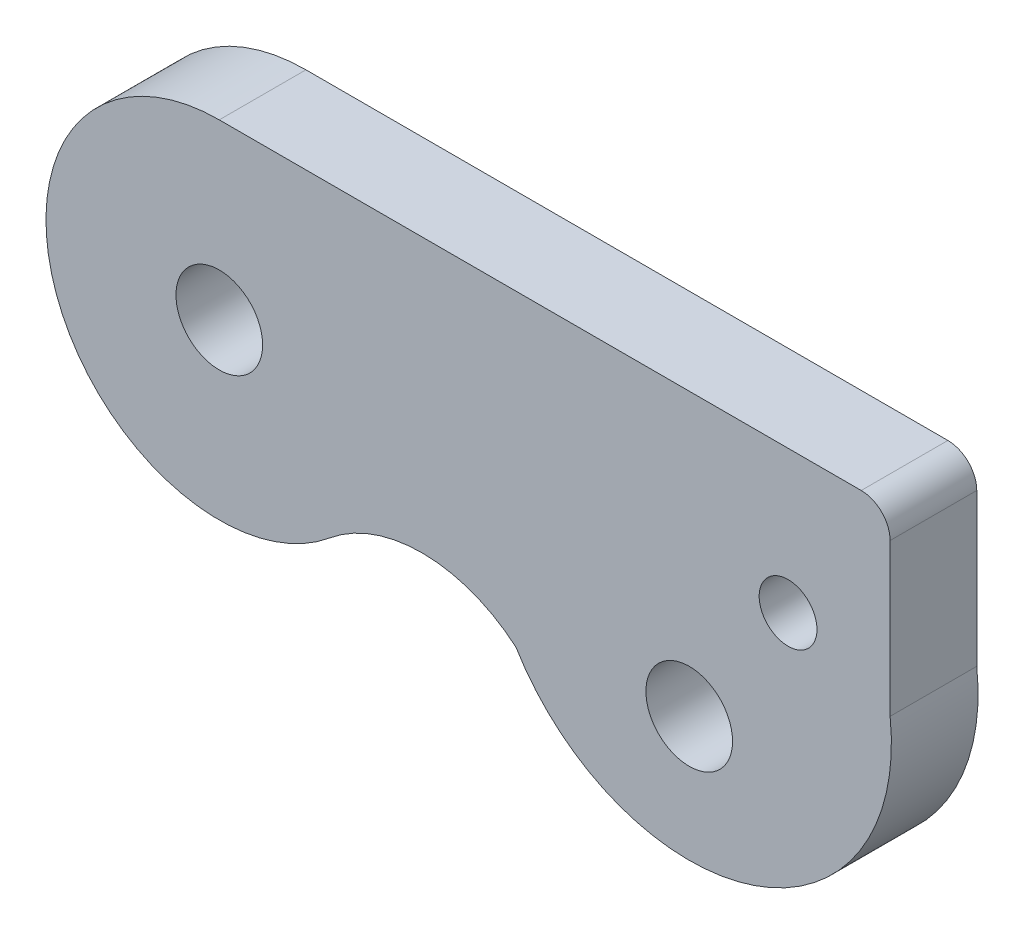
ISO-10303-21;
HEADER;
FILE_DESCRIPTION(('STEP AP214'),'2;1');
FILE_NAME('part.step','',(''),(''),'','','');
FILE_SCHEMA(('AUTOMOTIVE_DESIGN { 1 0 10303 214 1 1 1 1 }'));
ENDSEC;
DATA;
#1=APPLICATION_CONTEXT('core data for automotive mechanical design processes');
#2=APPLICATION_PROTOCOL_DEFINITION('international standard','automotive_design',2000,#1);
#3=PRODUCT_CONTEXT('',#1,'mechanical');
#4=PRODUCT('Part','Part','',(#3));
#5=PRODUCT_RELATED_PRODUCT_CATEGORY('part','',(#4));
#6=PRODUCT_DEFINITION_FORMATION('','',#4);
#7=PRODUCT_DEFINITION_CONTEXT('part definition',#1,'design');
#8=PRODUCT_DEFINITION('design','',#6,#7);
#9=PRODUCT_DEFINITION_SHAPE('','',#8);
#10=(LENGTH_UNIT() NAMED_UNIT(*) SI_UNIT(.MILLI.,.METRE.));
#11=(NAMED_UNIT(*) PLANE_ANGLE_UNIT() SI_UNIT($,.RADIAN.));
#12=(NAMED_UNIT(*) SI_UNIT($,.STERADIAN.) SOLID_ANGLE_UNIT());
#13=UNCERTAINTY_MEASURE_WITH_UNIT(LENGTH_MEASURE(1.E-05),#10,'distance_accuracy_value','');
#14=(GEOMETRIC_REPRESENTATION_CONTEXT(3) GLOBAL_UNCERTAINTY_ASSIGNED_CONTEXT((#13)) GLOBAL_UNIT_ASSIGNED_CONTEXT((#10,
#11,#12)) REPRESENTATION_CONTEXT('',''));
#15=CARTESIAN_POINT('',(0.,0.,0.));
#16=DIRECTION('',(0.,0.,1.));
#17=DIRECTION('',(1.,0.,0.));
#18=AXIS2_PLACEMENT_3D('',#15,#16,#17);
#19=CARTESIAN_POINT('',(0.,-6.,3.));
#20=DIRECTION('',(0.,0.,1.));
#21=DIRECTION('',(1.,0.,0.));
#22=AXIS2_PLACEMENT_3D('',#19,#20,#21);
#23=PLANE('',#22);
#24=CARTESIAN_POINT('',(19.6906458159987,-4.93616233806258,3.));
#25=DIRECTION('',(0.,0.,1.));
#26=DIRECTION('',(1.,0.,0.));
#27=AXIS2_PLACEMENT_3D('',#24,#25,#26);
#28=CIRCLE('',#27,0.999999999999994);
#29=CARTESIAN_POINT('',(20.6906458159987,-4.93616233806258,3.));
#30=VERTEX_POINT('',#29);
#31=EDGE_CURVE('E153',#30,#30,#28,.T.);
#32=ORIENTED_EDGE('',*,*,#31,.F.);
#33=EDGE_LOOP('',(#32));
#34=FACE_BOUND('',#33,.T.);
#35=CARTESIAN_POINT('',(0.,-6.,3.));
#36=DIRECTION('',(0.,0.,1.));
#37=DIRECTION('',(1.,0.,0.));
#38=AXIS2_PLACEMENT_3D('',#35,#36,#37);
#39=CIRCLE('',#38,6.);
#40=CARTESIAN_POINT('',(0.,0.,3.));
#41=VERTEX_POINT('',#40);
#42=CARTESIAN_POINT('',(3.82727225710111,-10.6208210385195,3.));
#43=VERTEX_POINT('',#42);
#44=EDGE_CURVE('E134',#41,#43,#39,.T.);
#45=ORIENTED_EDGE('',*,*,#44,.T.);
#46=CARTESIAN_POINT('',(7.01666580468537,-14.4715052372857,3.));
#47=DIRECTION('',(0.,0.,-1.));
#48=DIRECTION('',(-1.,0.,0.));
#49=AXIS2_PLACEMENT_3D('',#46,#47,#48);
#50=CIRCLE('',#49,5.);
#51=CARTESIAN_POINT('',(10.269229399763,-10.6740284355164,3.));
#52=VERTEX_POINT('',#51);
#53=EDGE_CURVE('E88',#43,#52,#50,.T.);
#54=ORIENTED_EDGE('',*,*,#53,.T.);
#55=CARTESIAN_POINT('',(16.2687627712159,-7.06770075700153,3.));
#56=DIRECTION('',(0.,0.,1.));
#57=DIRECTION('',(1.,0.,0.));
#58=AXIS2_PLACEMENT_3D('',#55,#56,#57);
#59=CIRCLE('',#58,7.);
#60=CARTESIAN_POINT('',(23.2233881055421,-6.2719706148369,3.));
#61=VERTEX_POINT('',#60);
#62=EDGE_CURVE('E102',#52,#61,#59,.T.);
#63=ORIENTED_EDGE('',*,*,#62,.T.);
#64=DIRECTION('',(0.,1.,0.));
#65=VECTOR('',#64,1.);
#66=CARTESIAN_POINT('',(23.2233881055421,-6.2719706148369,3.));
#67=LINE('',#66,#65);
#68=CARTESIAN_POINT('',(23.2233881055421,-1.,3.));
#69=VERTEX_POINT('',#68);
#70=EDGE_CURVE('E95',#61,#69,#67,.T.);
#71=ORIENTED_EDGE('',*,*,#70,.T.);
#72=CARTESIAN_POINT('',(22.2233881055421,-1.,3.));
#73=DIRECTION('',(0.,0.,1.));
#74=DIRECTION('',(1.,0.,0.));
#75=AXIS2_PLACEMENT_3D('',#72,#73,#74);
#76=CIRCLE('',#75,1.);
#77=CARTESIAN_POINT('',(22.2233881055421,0.,3.));
#78=VERTEX_POINT('',#77);
#79=EDGE_CURVE('E99',#69,#78,#76,.T.);
#80=ORIENTED_EDGE('',*,*,#79,.T.);
#81=DIRECTION('',(-1.,0.,0.));
#82=VECTOR('',#81,1.);
#83=CARTESIAN_POINT('',(22.,0.,3.));
#84=LINE('',#83,#82);
#85=EDGE_CURVE('E53',#78,#41,#84,.T.);
#86=ORIENTED_EDGE('',*,*,#85,.T.);
#87=EDGE_LOOP('',(#45,#54,#63,#71,#80,#86));
#88=FACE_BOUND('',#87,.T.);
#89=CARTESIAN_POINT('',(0.,-6.,3.));
#90=DIRECTION('',(0.,0.,1.));
#91=DIRECTION('',(1.,0.,0.));
#92=AXIS2_PLACEMENT_3D('',#89,#90,#91);
#93=CIRCLE('',#92,1.5);
#94=CARTESIAN_POINT('',(1.5,-6.,3.));
#95=VERTEX_POINT('',#94);
#96=EDGE_CURVE('E126',#95,#95,#93,.T.);
#97=ORIENTED_EDGE('',*,*,#96,.F.);
#98=EDGE_LOOP('',(#97));
#99=FACE_BOUND('',#98,.T.);
#100=CARTESIAN_POINT('',(16.2687627712159,-9.74796623904576,3.));
#101=DIRECTION('',(0.,0.,1.));
#102=DIRECTION('',(1.,0.,0.));
#103=AXIS2_PLACEMENT_3D('',#100,#101,#102);
#104=CIRCLE('',#103,1.5);
#105=CARTESIAN_POINT('',(17.7687627712159,-9.74796623904576,3.));
#106=VERTEX_POINT('',#105);
#107=EDGE_CURVE('E159',#106,#106,#104,.T.);
#108=ORIENTED_EDGE('',*,*,#107,.F.);
#109=EDGE_LOOP('',(#108));
#110=FACE_BOUND('',#109,.T.);
#111=ADVANCED_FACE('F36',(#34,#88,#99,#110),#23,.T.);
#112=CARTESIAN_POINT('',(0.,-6.,0.));
#113=DIRECTION('',(0.,0.,1.));
#114=DIRECTION('',(1.,0.,0.));
#115=AXIS2_PLACEMENT_3D('',#112,#113,#114);
#116=PLANE('',#115);
#117=CARTESIAN_POINT('',(0.,-6.,0.));
#118=DIRECTION('',(0.,0.,1.));
#119=DIRECTION('',(1.,0.,0.));
#120=AXIS2_PLACEMENT_3D('',#117,#118,#119);
#121=CIRCLE('',#120,6.);
#122=CARTESIAN_POINT('',(0.,0.,0.));
#123=VERTEX_POINT('',#122);
#124=CARTESIAN_POINT('',(3.82727225710111,-10.6208210385195,0.));
#125=VERTEX_POINT('',#124);
#126=EDGE_CURVE('E122',#123,#125,#121,.T.);
#127=ORIENTED_EDGE('',*,*,#126,.F.);
#128=DIRECTION('',(-1.,0.,0.));
#129=VECTOR('',#128,1.);
#130=CARTESIAN_POINT('',(0.,0.,0.));
#131=LINE('',#130,#129);
#132=CARTESIAN_POINT('',(22.2233881055421,0.,0.));
#133=VERTEX_POINT('',#132);
#134=EDGE_CURVE('E76',#133,#123,#131,.T.);
#135=ORIENTED_EDGE('',*,*,#134,.F.);
#136=CARTESIAN_POINT('',(22.2233881055421,-1.,0.));
#137=DIRECTION('',(0.,0.,1.));
#138=DIRECTION('',(1.,0.,0.));
#139=AXIS2_PLACEMENT_3D('',#136,#137,#138);
#140=CIRCLE('',#139,1.);
#141=CARTESIAN_POINT('',(23.2233881055421,-1.,0.));
#142=VERTEX_POINT('',#141);
#143=EDGE_CURVE('E131',#142,#133,#140,.T.);
#144=ORIENTED_EDGE('',*,*,#143,.F.);
#145=DIRECTION('',(0.,1.,0.));
#146=VECTOR('',#145,1.);
#147=CARTESIAN_POINT('',(23.2233881055421,-6.2719706148369,0.));
#148=LINE('',#147,#146);
#149=CARTESIAN_POINT('',(23.2233881055421,-6.2719706148369,0.));
#150=VERTEX_POINT('',#149);
#151=EDGE_CURVE('E111',#150,#142,#148,.T.);
#152=ORIENTED_EDGE('',*,*,#151,.F.);
#153=CARTESIAN_POINT('',(16.2687627712159,-7.06770075700153,0.));
#154=DIRECTION('',(0.,0.,1.));
#155=DIRECTION('',(1.,0.,0.));
#156=AXIS2_PLACEMENT_3D('',#153,#154,#155);
#157=CIRCLE('',#156,7.);
#158=CARTESIAN_POINT('',(10.269229399763,-10.6740284355164,0.));
#159=VERTEX_POINT('',#158);
#160=EDGE_CURVE('E128',#159,#150,#157,.T.);
#161=ORIENTED_EDGE('',*,*,#160,.F.);
#162=CARTESIAN_POINT('',(7.01666580468537,-14.4715052372857,0.));
#163=DIRECTION('',(0.,0.,-1.));
#164=DIRECTION('',(-1.,0.,0.));
#165=AXIS2_PLACEMENT_3D('',#162,#163,#164);
#166=CIRCLE('',#165,5.);
#167=EDGE_CURVE('E125',#125,#159,#166,.T.);
#168=ORIENTED_EDGE('',*,*,#167,.F.);
#169=EDGE_LOOP('',(#127,#135,#144,#152,#161,#168));
#170=FACE_BOUND('',#169,.T.);
#171=CARTESIAN_POINT('',(0.,-6.,0.));
#172=DIRECTION('',(0.,0.,1.));
#173=DIRECTION('',(1.,0.,0.));
#174=AXIS2_PLACEMENT_3D('',#171,#172,#173);
#175=CIRCLE('',#174,1.5);
#176=CARTESIAN_POINT('',(1.5,-6.,0.));
#177=VERTEX_POINT('',#176);
#178=EDGE_CURVE('E150',#177,#177,#175,.T.);
#179=ORIENTED_EDGE('',*,*,#178,.T.);
#180=EDGE_LOOP('',(#179));
#181=FACE_BOUND('',#180,.T.);
#182=CARTESIAN_POINT('',(19.6906458159987,-4.93616233806258,0.));
#183=DIRECTION('',(0.,0.,1.));
#184=DIRECTION('',(1.,0.,0.));
#185=AXIS2_PLACEMENT_3D('',#182,#183,#184);
#186=CIRCLE('',#185,0.999999999999994);
#187=CARTESIAN_POINT('',(20.6906458159987,-4.93616233806258,0.));
#188=VERTEX_POINT('',#187);
#189=EDGE_CURVE('E156',#188,#188,#186,.T.);
#190=ORIENTED_EDGE('',*,*,#189,.T.);
#191=EDGE_LOOP('',(#190));
#192=FACE_BOUND('',#191,.T.);
#193=CARTESIAN_POINT('',(16.2687627712159,-9.74796623904576,0.));
#194=DIRECTION('',(0.,0.,1.));
#195=DIRECTION('',(1.,0.,0.));
#196=AXIS2_PLACEMENT_3D('',#193,#194,#195);
#197=CIRCLE('',#196,1.5);
#198=CARTESIAN_POINT('',(17.7687627712159,-9.74796623904576,0.));
#199=VERTEX_POINT('',#198);
#200=EDGE_CURVE('E162',#199,#199,#197,.T.);
#201=ORIENTED_EDGE('',*,*,#200,.T.);
#202=EDGE_LOOP('',(#201));
#203=FACE_BOUND('',#202,.T.);
#204=ADVANCED_FACE('F141',(#170,#181,#192,#203),#116,.F.);
#205=CARTESIAN_POINT('',(0.,-6.,3.));
#206=DIRECTION('',(0.,0.,-1.));
#207=DIRECTION('',(-1.,0.,0.));
#208=AXIS2_PLACEMENT_3D('',#205,#206,#207);
#209=CYLINDRICAL_SURFACE('',#208,6.);
#210=ORIENTED_EDGE('',*,*,#126,.T.);
#211=DIRECTION('',(0.,0.,-1.));
#212=VECTOR('',#211,1.);
#213=CARTESIAN_POINT('',(3.82727225710111,-10.6208210385195,3.));
#214=LINE('',#213,#212);
#215=EDGE_CURVE('E11',#43,#125,#214,.T.);
#216=ORIENTED_EDGE('',*,*,#215,.F.);
#217=ORIENTED_EDGE('',*,*,#44,.F.);
#218=DIRECTION('',(0.,0.,-1.));
#219=VECTOR('',#218,1.);
#220=CARTESIAN_POINT('',(0.,0.,3.));
#221=LINE('',#220,#219);
#222=EDGE_CURVE('E118',#41,#123,#221,.T.);
#223=ORIENTED_EDGE('',*,*,#222,.T.);
#224=EDGE_LOOP('',(#210,#216,#217,#223));
#225=FACE_BOUND('',#224,.T.);
#226=ADVANCED_FACE('F38',(#225),#209,.T.);
#227=CARTESIAN_POINT('',(7.01666580468537,-14.4715052372857,3.));
#228=DIRECTION('',(0.,0.,-1.));
#229=DIRECTION('',(-1.,0.,0.));
#230=AXIS2_PLACEMENT_3D('',#227,#228,#229);
#231=CYLINDRICAL_SURFACE('',#230,5.);
#232=ORIENTED_EDGE('',*,*,#167,.T.);
#233=DIRECTION('',(0.,0.,-1.));
#234=VECTOR('',#233,1.);
#235=CARTESIAN_POINT('',(10.269229399763,-10.6740284355164,3.));
#236=LINE('',#235,#234);
#237=EDGE_CURVE('E45',#52,#159,#236,.T.);
#238=ORIENTED_EDGE('',*,*,#237,.F.);
#239=ORIENTED_EDGE('',*,*,#53,.F.);
#240=ORIENTED_EDGE('',*,*,#215,.T.);
#241=EDGE_LOOP('',(#232,#238,#239,#240));
#242=FACE_BOUND('',#241,.T.);
#243=ADVANCED_FACE('F190',(#242),#231,.F.);
#244=CARTESIAN_POINT('',(16.2687627712159,-7.06770075700153,3.));
#245=DIRECTION('',(0.,0.,-1.));
#246=DIRECTION('',(-1.,0.,0.));
#247=AXIS2_PLACEMENT_3D('',#244,#245,#246);
#248=CYLINDRICAL_SURFACE('',#247,7.);
#249=ORIENTED_EDGE('',*,*,#160,.T.);
#250=DIRECTION('',(0.,0.,-1.));
#251=VECTOR('',#250,1.);
#252=CARTESIAN_POINT('',(23.2233881055421,-6.2719706148369,3.));
#253=LINE('',#252,#251);
#254=EDGE_CURVE('E113',#61,#150,#253,.T.);
#255=ORIENTED_EDGE('',*,*,#254,.F.);
#256=ORIENTED_EDGE('',*,*,#62,.F.);
#257=ORIENTED_EDGE('',*,*,#237,.T.);
#258=EDGE_LOOP('',(#249,#255,#256,#257));
#259=FACE_BOUND('',#258,.T.);
#260=ADVANCED_FACE('F140',(#259),#248,.T.);
#261=CARTESIAN_POINT('',(23.2233881055421,-6.2719706148369,3.));
#262=DIRECTION('',(-1.,0.,0.));
#263=DIRECTION('',(0.,0.,1.));
#264=AXIS2_PLACEMENT_3D('',#261,#262,#263);
#265=PLANE('',#264);
#266=ORIENTED_EDGE('',*,*,#151,.T.);
#267=DIRECTION('',(0.,0.,-1.));
#268=VECTOR('',#267,1.);
#269=CARTESIAN_POINT('',(23.2233881055421,-1.,3.));
#270=LINE('',#269,#268);
#271=EDGE_CURVE('E108',#69,#142,#270,.T.);
#272=ORIENTED_EDGE('',*,*,#271,.F.);
#273=ORIENTED_EDGE('',*,*,#70,.F.);
#274=ORIENTED_EDGE('',*,*,#254,.T.);
#275=EDGE_LOOP('',(#266,#272,#273,#274));
#276=FACE_BOUND('',#275,.T.);
#277=ADVANCED_FACE('F109',(#276),#265,.F.);
#278=CARTESIAN_POINT('',(22.2233881055421,-1.,3.));
#279=DIRECTION('',(0.,0.,-1.));
#280=DIRECTION('',(-1.,0.,0.));
#281=AXIS2_PLACEMENT_3D('',#278,#279,#280);
#282=CYLINDRICAL_SURFACE('',#281,1.);
#283=ORIENTED_EDGE('',*,*,#143,.T.);
#284=DIRECTION('',(0.,0.,-1.));
#285=VECTOR('',#284,1.);
#286=CARTESIAN_POINT('',(22.2233881055421,0.,3.));
#287=LINE('',#286,#285);
#288=EDGE_CURVE('E114',#78,#133,#287,.T.);
#289=ORIENTED_EDGE('',*,*,#288,.F.);
#290=ORIENTED_EDGE('',*,*,#79,.F.);
#291=ORIENTED_EDGE('',*,*,#271,.T.);
#292=EDGE_LOOP('',(#283,#289,#290,#291));
#293=FACE_BOUND('',#292,.T.);
#294=ADVANCED_FACE('F116',(#293),#282,.T.);
#295=CARTESIAN_POINT('',(0.,0.,3.));
#296=DIRECTION('',(0.,-1.,0.));
#297=DIRECTION('',(0.,0.,-1.));
#298=AXIS2_PLACEMENT_3D('',#295,#296,#297);
#299=PLANE('',#298);
#300=ORIENTED_EDGE('',*,*,#134,.T.);
#301=ORIENTED_EDGE('',*,*,#222,.F.);
#302=ORIENTED_EDGE('',*,*,#85,.F.);
#303=ORIENTED_EDGE('',*,*,#288,.T.);
#304=EDGE_LOOP('',(#300,#301,#302,#303));
#305=FACE_BOUND('',#304,.T.);
#306=ADVANCED_FACE('F143',(#305),#299,.F.);
#307=CARTESIAN_POINT('',(0.,-6.,3.));
#308=DIRECTION('',(0.,0.,-1.));
#309=DIRECTION('',(-1.,0.,0.));
#310=AXIS2_PLACEMENT_3D('',#307,#308,#309);
#311=CYLINDRICAL_SURFACE('',#310,1.5);
#312=ORIENTED_EDGE('',*,*,#96,.T.);
#313=EDGE_LOOP('',(#312));
#314=FACE_BOUND('',#313,.T.);
#315=ORIENTED_EDGE('',*,*,#178,.F.);
#316=EDGE_LOOP('',(#315));
#317=FACE_BOUND('',#316,.T.);
#318=ADVANCED_FACE('F180',(#314,#317),#311,.F.);
#319=CARTESIAN_POINT('',(19.6906458159987,-4.93616233806258,3.));
#320=DIRECTION('',(0.,0.,-1.));
#321=DIRECTION('',(-1.,0.,0.));
#322=AXIS2_PLACEMENT_3D('',#319,#320,#321);
#323=CYLINDRICAL_SURFACE('',#322,0.999999999999994);
#324=ORIENTED_EDGE('',*,*,#31,.T.);
#325=EDGE_LOOP('',(#324));
#326=FACE_BOUND('',#325,.T.);
#327=ORIENTED_EDGE('',*,*,#189,.F.);
#328=EDGE_LOOP('',(#327));
#329=FACE_BOUND('',#328,.T.);
#330=ADVANCED_FACE('F244',(#326,#329),#323,.F.);
#331=CARTESIAN_POINT('',(16.2687627712159,-9.74796623904576,3.));
#332=DIRECTION('',(0.,0.,-1.));
#333=DIRECTION('',(-1.,0.,0.));
#334=AXIS2_PLACEMENT_3D('',#331,#332,#333);
#335=CYLINDRICAL_SURFACE('',#334,1.5);
#336=ORIENTED_EDGE('',*,*,#107,.T.);
#337=EDGE_LOOP('',(#336));
#338=FACE_BOUND('',#337,.T.);
#339=ORIENTED_EDGE('',*,*,#200,.F.);
#340=EDGE_LOOP('',(#339));
#341=FACE_BOUND('',#340,.T.);
#342=ADVANCED_FACE('F168',(#338,#341),#335,.F.);
#343=CLOSED_SHELL('',(#111,#204,#226,#243,#260,#277,#294,#306,#318,#330,#342));
#344=MANIFOLD_SOLID_BREP('B2',#343);
#345=ADVANCED_BREP_SHAPE_REPRESENTATION('',(#18,#344),#14);
#346=SHAPE_DEFINITION_REPRESENTATION(#9,#345);
ENDSEC;
END-ISO-10303-21;
